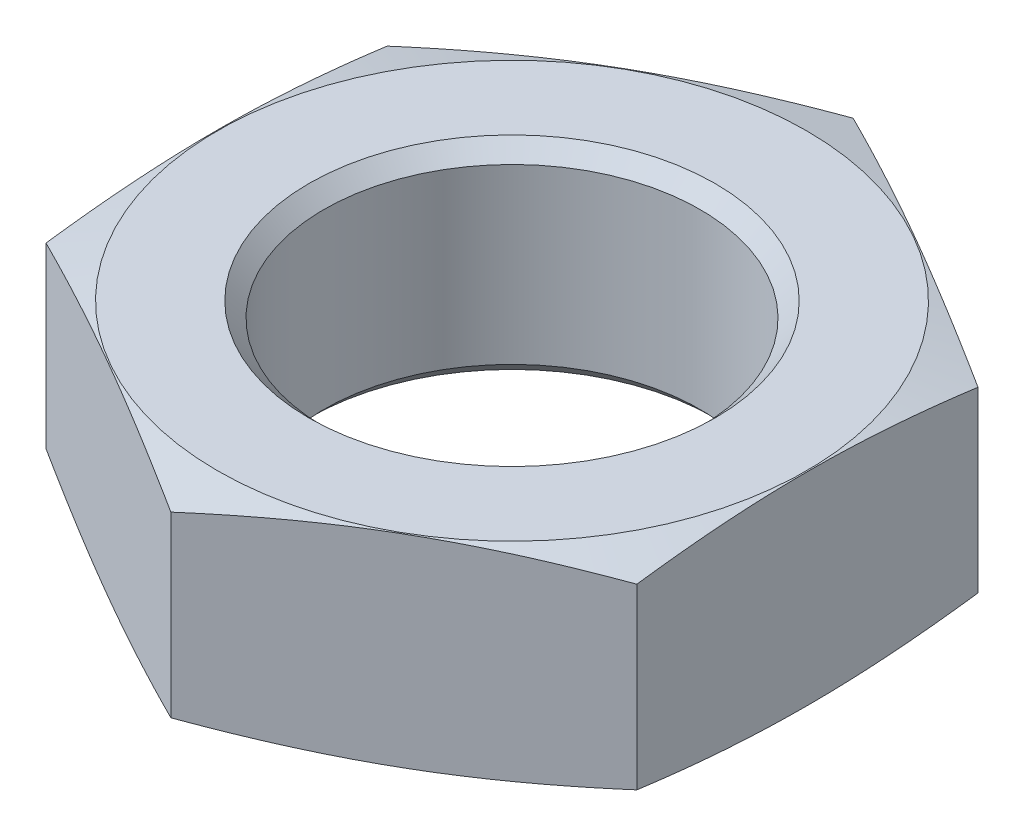
ISO-10303-21;
HEADER;
FILE_DESCRIPTION(('STEP AP214'),'2;1');
FILE_NAME('part.step','',(''),(''),'','','');
FILE_SCHEMA(('AUTOMOTIVE_DESIGN { 1 0 10303 214 1 1 1 1 }'));
ENDSEC;
DATA;
#1=APPLICATION_CONTEXT('core data for automotive mechanical design processes');
#2=APPLICATION_PROTOCOL_DEFINITION('international standard','automotive_design',2000,#1);
#3=PRODUCT_CONTEXT('',#1,'mechanical');
#4=PRODUCT('Part','Part','',(#3));
#5=PRODUCT_RELATED_PRODUCT_CATEGORY('part','',(#4));
#6=PRODUCT_DEFINITION_FORMATION('','',#4);
#7=PRODUCT_DEFINITION_CONTEXT('part definition',#1,'design');
#8=PRODUCT_DEFINITION('design','',#6,#7);
#9=PRODUCT_DEFINITION_SHAPE('','',#8);
#10=(LENGTH_UNIT() NAMED_UNIT(*) SI_UNIT(.MILLI.,.METRE.));
#11=(NAMED_UNIT(*) PLANE_ANGLE_UNIT() SI_UNIT($,.RADIAN.));
#12=(NAMED_UNIT(*) SI_UNIT($,.STERADIAN.) SOLID_ANGLE_UNIT());
#13=UNCERTAINTY_MEASURE_WITH_UNIT(LENGTH_MEASURE(1.E-05),#10,'distance_accuracy_value','');
#14=(GEOMETRIC_REPRESENTATION_CONTEXT(3) GLOBAL_UNCERTAINTY_ASSIGNED_CONTEXT((#13)) GLOBAL_UNIT_ASSIGNED_CONTEXT((#10,
#11,#12)) REPRESENTATION_CONTEXT('',''));
#15=CARTESIAN_POINT('',(0.,0.,0.));
#16=DIRECTION('',(0.,0.,1.));
#17=DIRECTION('',(1.,0.,0.));
#18=AXIS2_PLACEMENT_3D('',#15,#16,#17);
#19=CARTESIAN_POINT('',(0.,0.,0.));
#20=DIRECTION('',(0.,1.,0.));
#21=DIRECTION('',(0.,0.,1.));
#22=AXIS2_PLACEMENT_3D('',#19,#20,#21);
#23=PLANE('',#22);
#24=CARTESIAN_POINT('',(0.,0.,0.));
#25=DIRECTION('',(0.,-1.,0.));
#26=DIRECTION('',(0.,0.,-1.));
#27=AXIS2_PLACEMENT_3D('',#24,#25,#26);
#28=CIRCLE('',#27,15.95);
#29=CARTESIAN_POINT('',(0.,0.,-15.95));
#30=VERTEX_POINT('',#29);
#31=EDGE_CURVE('E114',#30,#30,#28,.T.);
#32=ORIENTED_EDGE('',*,*,#31,.F.);
#33=EDGE_LOOP('',(#32));
#34=FACE_BOUND('',#33,.T.);
#35=CARTESIAN_POINT('',(0.,0.,0.));
#36=DIRECTION('',(0.,1.,0.));
#37=DIRECTION('',(0.,0.,1.));
#38=AXIS2_PLACEMENT_3D('',#35,#36,#37);
#39=CIRCLE('',#38,11.);
#40=CARTESIAN_POINT('',(0.,0.,11.));
#41=VERTEX_POINT('',#40);
#42=EDGE_CURVE('E105',#41,#41,#39,.T.);
#43=ORIENTED_EDGE('',*,*,#42,.F.);
#44=EDGE_LOOP('',(#43));
#45=FACE_BOUND('',#44,.T.);
#46=ADVANCED_FACE('F36',(#34,#45),#23,.T.);
#47=CARTESIAN_POINT('',(15.95,-11.,0.));
#48=DIRECTION('',(0.,-1.,0.));
#49=DIRECTION('',(0.,0.,-1.));
#50=AXIS2_PLACEMENT_3D('',#47,#48,#49);
#51=PLANE('',#50);
#52=CARTESIAN_POINT('',(0.,-11.,0.));
#53=DIRECTION('',(0.,-1.,0.));
#54=DIRECTION('',(0.,0.,-1.));
#55=AXIS2_PLACEMENT_3D('',#52,#53,#54);
#56=CIRCLE('',#55,15.95);
#57=CARTESIAN_POINT('',(0.,-11.,-15.95));
#58=VERTEX_POINT('',#57);
#59=EDGE_CURVE('E111',#58,#58,#56,.T.);
#60=ORIENTED_EDGE('',*,*,#59,.T.);
#61=EDGE_LOOP('',(#60));
#62=FACE_BOUND('',#61,.T.);
#63=CARTESIAN_POINT('',(0.,-11.,0.));
#64=DIRECTION('',(0.,1.,0.));
#65=DIRECTION('',(0.,0.,1.));
#66=AXIS2_PLACEMENT_3D('',#63,#64,#65);
#67=CIRCLE('',#66,11.);
#68=CARTESIAN_POINT('',(0.,-11.,11.));
#69=VERTEX_POINT('',#68);
#70=EDGE_CURVE('E348',#69,#69,#67,.T.);
#71=ORIENTED_EDGE('',*,*,#70,.T.);
#72=EDGE_LOOP('',(#71));
#73=FACE_BOUND('',#72,.T.);
#74=ADVANCED_FACE('F137',(#62,#73),#51,.T.);
#75=CARTESIAN_POINT('',(0.,-5.5,0.));
#76=DIRECTION('',(0.,-1.,0.));
#77=DIRECTION('',(0.,0.,-1.));
#78=AXIS2_PLACEMENT_3D('',#75,#76,#77);
#79=CONICAL_SURFACE('',#78,36.476279441629,1.30899693899575);
#80=ORIENTED_EDGE('',*,*,#31,.T.);
#81=EDGE_LOOP('',(#80));
#82=FACE_BOUND('',#81,.T.);
#83=CARTESIAN_POINT('',(0.000200000000000058,-0.676658549257367,-18.4753240841218));
#84=CARTESIAN_POINT('',(-0.664256425539981,-0.573825955198311,-18.0916999879716));
#85=CARTESIAN_POINT('',(-1.32991754536375,-0.480471105415214,-17.7073803612522));
#86=CARTESIAN_POINT('',(-2.66359049888979,-0.316455601474747,-16.9373839225231));
#87=CARTESIAN_POINT('',(-3.33160317627743,-0.24580416423021,-16.5517066234112));
#88=CARTESIAN_POINT('',(-4.66592929612311,-0.131319876837691,-15.7813330789316));
#89=CARTESIAN_POINT('',(-5.3322337168711,-0.0873505062203012,-15.3966420422505));
#90=CARTESIAN_POINT('',(-6.66569221799257,-0.0283921008023866,-14.6267694176748));
#91=CARTESIAN_POINT('',(-7.33284610899628,-0.0133974596215517,-14.2415879391129));
#92=CARTESIAN_POINT('',(-8.66715389100372,-0.0133974596215524,-13.4712249819891));
#93=CARTESIAN_POINT('',(-9.33430778200743,-0.0283921008023879,-13.0860435034272));
#94=CARTESIAN_POINT('',(-10.6677662831289,-0.0873505062203029,-12.3161708788515));
#95=CARTESIAN_POINT('',(-11.3340707038769,-0.131319876837692,-11.9314798421704));
#96=CARTESIAN_POINT('',(-12.6683968237226,-0.245804164230211,-11.1611062976908));
#97=CARTESIAN_POINT('',(-13.3364095011102,-0.316455601474749,-10.7754289985789));
#98=CARTESIAN_POINT('',(-14.6700824546362,-0.480471105415218,-10.0054325598498));
#99=CARTESIAN_POINT('',(-15.33574357446,-0.573825955198315,-9.62111293313044));
#100=CARTESIAN_POINT('',(-16.0002,-0.676658549257372,-9.23748883698016));
#101=B_SPLINE_CURVE_WITH_KNOTS('',3,(#83,#84,#85,#86,#87,#88,#89,#90,#91,#92,#93,#94,#95,#96,
#97,#98,#99,#100),.UNSPECIFIED.,.F.,.F.,(4,2,2,2,2,2,2,2,4),(0.,2.32244786299619,
4.64583738335102,6.957236637786,9.26818860999879,11.5791405822116,13.8905398366466,
16.2139293570014,18.5363772199976),.UNSPECIFIED.);
#102=CARTESIAN_POINT('',(0.,-0.676627608859629,-18.475208614068));
#103=VERTEX_POINT('',#102);
#104=CARTESIAN_POINT('',(-16.,-0.676627608859635,-9.237604307034));
#105=VERTEX_POINT('',#104);
#106=EDGE_CURVE('E110',#103,#105,#101,.T.);
#107=ORIENTED_EDGE('',*,*,#106,.T.);
#108=CARTESIAN_POINT('',(-16.,-3.62774199219797,-24.7708750610416));
#109=CARTESIAN_POINT('',(-16.,-3.46351002450146,-24.0410196926535));
#110=CARTESIAN_POINT('',(-16.,-3.3012316789468,-23.3107169160599));
#111=CARTESIAN_POINT('',(-16.,-2.98163752452867,-21.8489960429334));
#112=CARTESIAN_POINT('',(-16.,-2.82432192039089,-21.1175779016903));
#113=CARTESIAN_POINT('',(-16.,-2.51558249709015,-19.6528028696696));
#114=CARTESIAN_POINT('',(-16.,-2.36416414324443,-18.9194448229351));
#115=CARTESIAN_POINT('',(-16.,-2.06879994828159,-17.4512262023437));
#116=CARTESIAN_POINT('',(-16.,-1.92485404730293,-16.7163656405723));
#117=CARTESIAN_POINT('',(-16.,-1.64736851170715,-15.2509326225095));
#118=CARTESIAN_POINT('',(-16.,-1.51375303884585,-14.5203745955153));
#119=CARTESIAN_POINT('',(-16.,-1.25782069758783,-13.0572667717478));
#120=CARTESIAN_POINT('',(-16.,-1.13550386966443,-12.3247169678493));
#121=CARTESIAN_POINT('',(-16.,-0.90485600230211,-10.8574664240545));
#122=CARTESIAN_POINT('',(-16.,-0.796523728773387,-10.1227658798136));
#123=CARTESIAN_POINT('',(-16.,-0.596974344055776,-8.65101734263474));
#124=CARTESIAN_POINT('',(-16.,-0.505757263283094,-7.91396934552738));
#125=CARTESIAN_POINT('',(-16.,-0.342943123303334,-6.42904639914294));
#126=CARTESIAN_POINT('',(-16.,-0.27158523987824,-5.68114483581523));
#127=CARTESIAN_POINT('',(-16.,-0.153369647571492,-4.18339082513652));
#128=CARTESIAN_POINT('',(-16.,-0.106511375565153,-3.43353842302381));
#129=CARTESIAN_POINT('',(-16.,-0.0400229807772697,-1.93298851255599));
#130=CARTESIAN_POINT('',(-16.,-0.0203788867534141,-1.18229163600119));
#131=CARTESIAN_POINT('',(-16.,-0.00953346324580208,0.319309829646697));
#132=CARTESIAN_POINT('',(-16.,-0.0183320549205155,1.07021441815825));
#133=CARTESIAN_POINT('',(-16.,-0.0638883698870331,2.57413048696097));
#134=CARTESIAN_POINT('',(-16.,-0.10075655016124,3.32713855210808));
#135=CARTESIAN_POINT('',(-16.,-0.200327668268556,4.83142906312342));
#136=CARTESIAN_POINT('',(-16.,-0.263031200721038,5.58271146887412));
#137=CARTESIAN_POINT('',(-16.,-0.411024077746778,7.08354735280372));
#138=CARTESIAN_POINT('',(-16.,-0.496329299356741,7.83309924051592));
#139=CARTESIAN_POINT('',(-16.,-0.685873338036574,9.32977555662255));
#140=CARTESIAN_POINT('',(-16.,-0.790112178817329,10.0768999819758));
#141=CARTESIAN_POINT('',(-16.,-1.01792157147905,11.5943517577453));
#142=CARTESIAN_POINT('',(-16.,-1.14203198881389,12.3645973089126));
#143=CARTESIAN_POINT('',(-16.,-1.40354465060315,13.9028412427698));
#144=CARTESIAN_POINT('',(-16.,-1.54094741021767,14.6708395371753));
#145=CARTESIAN_POINT('',(-16.,-1.82637313878195,16.2049616793753));
#146=CARTESIAN_POINT('',(-16.,-1.97439761083086,16.9710852459475));
#147=CARTESIAN_POINT('',(-16.,-2.2789114596203,18.5016305435053));
#148=CARTESIAN_POINT('',(-16.,-2.43540072480265,19.266052296781));
#149=CARTESIAN_POINT('',(-16.,-2.75523400075419,20.7937592932322));
#150=CARTESIAN_POINT('',(-16.,-2.91858059471854,21.5570439938992));
#151=CARTESIAN_POINT('',(-16.,-3.25076843519386,23.0824157930496));
#152=CARTESIAN_POINT('',(-16.,-3.41960969460553,23.8445028887169));
#153=CARTESIAN_POINT('',(-16.,-3.76175139763648,25.3676034012425));
#154=CARTESIAN_POINT('',(-16.,-3.93505144857046,26.1286169064672));
#155=CARTESIAN_POINT('',(-16.,-4.28533304822626,27.6497969695007));
#156=CARTESIAN_POINT('',(-16.,-4.46231460688866,28.4099635250167));
#157=CARTESIAN_POINT('',(-16.,-4.99372983726429,30.6720556501963));
#158=CARTESIAN_POINT('',(-16.,-5.35257008375717,32.1729457766813));
#159=CARTESIAN_POINT('',(-16.,-6.07858762086328,35.1727396242923));
#160=CARTESIAN_POINT('',(-16.,-6.4457651200045,36.6716432947392));
#161=CARTESIAN_POINT('',(-16.,-7.18563805959825,39.6656628161139));
#162=CARTESIAN_POINT('',(-16.,-7.55832423752252,41.1607809583153));
#163=CARTESIAN_POINT('',(-16.,-8.12075068317079,43.402573801004));
#164=CARTESIAN_POINT('',(-16.,-8.30878874741106,44.1496764644027));
#165=CARTESIAN_POINT('',(-16.,-8.68586359570953,45.6436289887007));
#166=CARTESIAN_POINT('',(-16.,-8.87490037881613,46.3904788498401));
#167=CARTESIAN_POINT('',(-16.,-9.06436871706437,47.137219260078));
#168=B_SPLINE_CURVE_WITH_KNOTS('',3,(#108,#109,#110,#111,#112,#113,#114,#115,#116,#117,#118,
#119,#120,#121,#122,#123,#124,#125,#126,#127,#128,#129,#130,#131,#132,#133,#134,#135,#136,#137,
#138,#139,#140,#141,#142,#143,#144,#145,#146,#147,#148,#149,#150,#151,#152,#153,#154,#155,#156,
#157,#158,#159,#160,#161,#162,#163,#164,#165,#166,#167),.UNSPECIFIED.,.F.,.F.,(4,2,2,2,2,2,2,2,
2,2,2,2,2,2,2,2,2,2,2,2,2,2,2,2,2,2,2,2,2,4),(0.,2.24432353506649,4.48873953343089,
6.73518832944211,8.98161912645846,11.2095772964548,13.4375434469966,15.6653128524322,
17.8930862169031,20.1466309586424,22.400123900276,24.6524595121588,26.9047888806989,
29.1660275237924,31.427318213841,33.6902016266707,35.9530878733663,38.2934841038468,
40.6339710754566,42.9747899095949,45.3155779014114,47.6572557363191,49.9989390695457,
52.3404168721686,54.6819009979208,59.3114337618147,63.9410824455326,68.5636752739821,
70.8748836420539,73.1860898084),.UNSPECIFIED.);
#169=CARTESIAN_POINT('',(-16.,-0.676627608859635,9.237604307034));
#170=VERTEX_POINT('',#169);
#171=EDGE_CURVE('E102',#105,#170,#168,.T.);
#172=ORIENTED_EDGE('',*,*,#171,.T.);
#173=CARTESIAN_POINT('',(-16.0002,-0.676658549257373,9.23748883698016));
#174=CARTESIAN_POINT('',(-15.33574357446,-0.573825955198317,9.62111293313044));
#175=CARTESIAN_POINT('',(-14.6700824546362,-0.480471105415219,10.0054325598498));
#176=CARTESIAN_POINT('',(-13.3364095011102,-0.31645560147475,10.7754289985789));
#177=CARTESIAN_POINT('',(-12.6683968237226,-0.245804164230212,11.1611062976908));
#178=CARTESIAN_POINT('',(-11.3340707038769,-0.131319876837693,11.9314798421704));
#179=CARTESIAN_POINT('',(-10.6677662831289,-0.0873505062203036,12.3161708788515));
#180=CARTESIAN_POINT('',(-9.33430778200743,-0.028392100802388,13.0860435034272));
#181=CARTESIAN_POINT('',(-8.66715389100372,-0.0133974596215515,13.4712249819891));
#182=CARTESIAN_POINT('',(-7.33284610899628,-0.0133974596215504,14.2415879391129));
#183=CARTESIAN_POINT('',(-6.66569221799256,-0.0283921008023858,14.6267694176748));
#184=CARTESIAN_POINT('',(-5.3322337168711,-0.0873505062203006,15.3966420422505));
#185=CARTESIAN_POINT('',(-4.6659292961231,-0.13131987683769,15.7813330789316));
#186=CARTESIAN_POINT('',(-3.33160317627743,-0.245804164230209,16.5517066234112));
#187=CARTESIAN_POINT('',(-2.66359049888979,-0.316455601474747,16.9373839225231));
#188=CARTESIAN_POINT('',(-1.32991754536375,-0.480471105415214,17.7073803612522));
#189=CARTESIAN_POINT('',(-0.664256425539977,-0.573825955198311,18.0916999879716));
#190=CARTESIAN_POINT('',(0.000200000000002396,-0.676658549257367,18.4753240841218));
#191=B_SPLINE_CURVE_WITH_KNOTS('',3,(#173,#174,#175,#176,#177,#178,#179,#180,#181,#182,#183,
#184,#185,#186,#187,#188,#189,#190),.UNSPECIFIED.,.F.,.F.,(4,2,2,2,2,2,2,2,4),(0.,
2.32244786299619,4.64583738335102,6.957236637786,9.26818860999879,11.5791405822116,
13.8905398366466,16.2139293570014,18.5363772199976),.UNSPECIFIED.);
#192=CARTESIAN_POINT('',(0.,-0.67662760885963,18.475208614068));
#193=VERTEX_POINT('',#192);
#194=EDGE_CURVE('E91',#170,#193,#191,.T.);
#195=ORIENTED_EDGE('',*,*,#194,.T.);
#196=CARTESIAN_POINT('',(-0.000200000000000058,-0.676658549257367,18.4753240841218));
#197=CARTESIAN_POINT('',(0.664256425539981,-0.573825955198311,18.0916999879716));
#198=CARTESIAN_POINT('',(1.32991754536375,-0.480471105415214,17.7073803612522));
#199=CARTESIAN_POINT('',(2.66359049888979,-0.316455601474747,16.9373839225231));
#200=CARTESIAN_POINT('',(3.33160317627743,-0.24580416423021,16.5517066234112));
#201=CARTESIAN_POINT('',(4.66592929612311,-0.131319876837691,15.7813330789316));
#202=CARTESIAN_POINT('',(5.3322337168711,-0.0873505062203012,15.3966420422505));
#203=CARTESIAN_POINT('',(6.66569221799257,-0.0283921008023866,14.6267694176748));
#204=CARTESIAN_POINT('',(7.33284610899628,-0.0133974596215517,14.2415879391129));
#205=CARTESIAN_POINT('',(8.66715389100372,-0.0133974596215524,13.4712249819891));
#206=CARTESIAN_POINT('',(9.33430778200743,-0.0283921008023879,13.0860435034272));
#207=CARTESIAN_POINT('',(10.6677662831289,-0.0873505062203029,12.3161708788515));
#208=CARTESIAN_POINT('',(11.3340707038769,-0.131319876837692,11.9314798421704));
#209=CARTESIAN_POINT('',(12.6683968237226,-0.245804164230211,11.1611062976908));
#210=CARTESIAN_POINT('',(13.3364095011102,-0.316455601474749,10.7754289985789));
#211=CARTESIAN_POINT('',(14.6700824546362,-0.480471105415218,10.0054325598498));
#212=CARTESIAN_POINT('',(15.33574357446,-0.573825955198315,9.62111293313044));
#213=CARTESIAN_POINT('',(16.0002,-0.676658549257372,9.23748883698016));
#214=B_SPLINE_CURVE_WITH_KNOTS('',3,(#196,#197,#198,#199,#200,#201,#202,#203,#204,#205,#206,
#207,#208,#209,#210,#211,#212,#213),.UNSPECIFIED.,.F.,.F.,(4,2,2,2,2,2,2,2,4),(0.,
2.32244786299619,4.64583738335102,6.957236637786,9.26818860999879,11.5791405822116,
13.8905398366466,16.2139293570014,18.5363772199976),.UNSPECIFIED.);
#215=CARTESIAN_POINT('',(16.,-0.676627608859635,9.237604307034));
#216=VERTEX_POINT('',#215);
#217=EDGE_CURVE('E96',#193,#216,#214,.T.);
#218=ORIENTED_EDGE('',*,*,#217,.T.);
#219=CARTESIAN_POINT('',(16.,-3.62774199219797,-24.7708750610416));
#220=CARTESIAN_POINT('',(16.,-3.46351002450146,-24.0410196926535));
#221=CARTESIAN_POINT('',(16.,-3.3012316789468,-23.3107169160599));
#222=CARTESIAN_POINT('',(16.,-2.98163752452867,-21.8489960429334));
#223=CARTESIAN_POINT('',(16.,-2.82432192039089,-21.1175779016903));
#224=CARTESIAN_POINT('',(16.,-2.51558249709015,-19.6528028696696));
#225=CARTESIAN_POINT('',(16.,-2.36416414324443,-18.9194448229351));
#226=CARTESIAN_POINT('',(16.,-2.06879994828159,-17.4512262023437));
#227=CARTESIAN_POINT('',(16.,-1.92485404730293,-16.7163656405723));
#228=CARTESIAN_POINT('',(16.,-1.64736851170715,-15.2509326225095));
#229=CARTESIAN_POINT('',(16.,-1.51375303884585,-14.5203745955153));
#230=CARTESIAN_POINT('',(16.,-1.25782069758783,-13.0572667717478));
#231=CARTESIAN_POINT('',(16.,-1.13550386966443,-12.3247169678493));
#232=CARTESIAN_POINT('',(16.,-0.90485600230211,-10.8574664240545));
#233=CARTESIAN_POINT('',(16.,-0.796523728773387,-10.1227658798136));
#234=CARTESIAN_POINT('',(16.,-0.596974344055776,-8.65101734263474));
#235=CARTESIAN_POINT('',(16.,-0.505757263283094,-7.91396934552738));
#236=CARTESIAN_POINT('',(16.,-0.342943123303334,-6.42904639914294));
#237=CARTESIAN_POINT('',(16.,-0.27158523987824,-5.68114483581523));
#238=CARTESIAN_POINT('',(16.,-0.153369647571492,-4.18339082513652));
#239=CARTESIAN_POINT('',(16.,-0.106511375565153,-3.43353842302381));
#240=CARTESIAN_POINT('',(16.,-0.0400229807772697,-1.93298851255599));
#241=CARTESIAN_POINT('',(16.,-0.0203788867534141,-1.18229163600119));
#242=CARTESIAN_POINT('',(16.,-0.00953346324580208,0.319309829646697));
#243=CARTESIAN_POINT('',(16.,-0.0183320549205155,1.07021441815825));
#244=CARTESIAN_POINT('',(16.,-0.0638883698870331,2.57413048696097));
#245=CARTESIAN_POINT('',(16.,-0.10075655016124,3.32713855210808));
#246=CARTESIAN_POINT('',(16.,-0.200327668268556,4.83142906312342));
#247=CARTESIAN_POINT('',(16.,-0.263031200721038,5.58271146887412));
#248=CARTESIAN_POINT('',(16.,-0.411024077746778,7.08354735280372));
#249=CARTESIAN_POINT('',(16.,-0.496329299356741,7.83309924051592));
#250=CARTESIAN_POINT('',(16.,-0.685873338036574,9.32977555662255));
#251=CARTESIAN_POINT('',(16.,-0.790112178817329,10.0768999819758));
#252=CARTESIAN_POINT('',(16.,-1.01792157147905,11.5943517577453));
#253=CARTESIAN_POINT('',(16.,-1.14203198881389,12.3645973089126));
#254=CARTESIAN_POINT('',(16.,-1.40354465060315,13.9028412427698));
#255=CARTESIAN_POINT('',(16.,-1.54094741021767,14.6708395371753));
#256=CARTESIAN_POINT('',(16.,-1.82637313878195,16.2049616793753));
#257=CARTESIAN_POINT('',(16.,-1.97439761083086,16.9710852459475));
#258=CARTESIAN_POINT('',(16.,-2.2789114596203,18.5016305435053));
#259=CARTESIAN_POINT('',(16.,-2.43540072480265,19.266052296781));
#260=CARTESIAN_POINT('',(16.,-2.75523400075419,20.7937592932322));
#261=CARTESIAN_POINT('',(16.,-2.91858059471854,21.5570439938992));
#262=CARTESIAN_POINT('',(16.,-3.25076843519386,23.0824157930496));
#263=CARTESIAN_POINT('',(16.,-3.41960969460553,23.8445028887169));
#264=CARTESIAN_POINT('',(16.,-3.76175139763648,25.3676034012425));
#265=CARTESIAN_POINT('',(16.,-3.93505144857046,26.1286169064672));
#266=CARTESIAN_POINT('',(16.,-4.28533304822626,27.6497969695007));
#267=CARTESIAN_POINT('',(16.,-4.46231460688866,28.4099635250167));
#268=CARTESIAN_POINT('',(16.,-4.99372983726429,30.6720556501963));
#269=CARTESIAN_POINT('',(16.,-5.35257008375717,32.1729457766813));
#270=CARTESIAN_POINT('',(16.,-6.07858762086328,35.1727396242923));
#271=CARTESIAN_POINT('',(16.,-6.4457651200045,36.6716432947392));
#272=CARTESIAN_POINT('',(16.,-7.18563805959825,39.6656628161139));
#273=CARTESIAN_POINT('',(16.,-7.55832423752252,41.1607809583153));
#274=CARTESIAN_POINT('',(16.,-8.12075068317079,43.402573801004));
#275=CARTESIAN_POINT('',(16.,-8.30878874741106,44.1496764644027));
#276=CARTESIAN_POINT('',(16.,-8.68586359570953,45.6436289887007));
#277=CARTESIAN_POINT('',(16.,-8.87490037881613,46.3904788498401));
#278=CARTESIAN_POINT('',(16.,-9.06436871706437,47.137219260078));
#279=B_SPLINE_CURVE_WITH_KNOTS('',3,(#219,#220,#221,#222,#223,#224,#225,#226,#227,#228,#229,
#230,#231,#232,#233,#234,#235,#236,#237,#238,#239,#240,#241,#242,#243,#244,#245,#246,#247,#248,
#249,#250,#251,#252,#253,#254,#255,#256,#257,#258,#259,#260,#261,#262,#263,#264,#265,#266,#267,
#268,#269,#270,#271,#272,#273,#274,#275,#276,#277,#278),.UNSPECIFIED.,.F.,.F.,(4,2,2,2,2,2,2,2,
2,2,2,2,2,2,2,2,2,2,2,2,2,2,2,2,2,2,2,2,2,4),(0.,2.24432353506649,4.48873953343089,
6.73518832944211,8.98161912645846,11.2095772964548,13.4375434469966,15.6653128524322,
17.8930862169031,20.1466309586424,22.400123900276,24.6524595121588,26.9047888806989,
29.1660275237924,31.427318213841,33.6902016266707,35.9530878733663,38.2934841038468,
40.6339710754566,42.9747899095949,45.3155779014114,47.6572557363191,49.9989390695457,
52.3404168721686,54.6819009979208,59.3114337618147,63.9410824455326,68.5636752739821,
70.8748836420539,73.1860898084),.UNSPECIFIED.);
#280=CARTESIAN_POINT('',(16.,-0.676627608859635,-9.237604307034));
#281=VERTEX_POINT('',#280);
#282=EDGE_CURVE('E200',#216,#281,#279,.F.);
#283=ORIENTED_EDGE('',*,*,#282,.T.);
#284=CARTESIAN_POINT('',(16.0002,-0.676658549257373,-9.23748883698016));
#285=CARTESIAN_POINT('',(15.33574357446,-0.573825955198317,-9.62111293313044));
#286=CARTESIAN_POINT('',(14.6700824546362,-0.480471105415219,-10.0054325598498));
#287=CARTESIAN_POINT('',(13.3364095011102,-0.31645560147475,-10.7754289985789));
#288=CARTESIAN_POINT('',(12.6683968237226,-0.245804164230212,-11.1611062976908));
#289=CARTESIAN_POINT('',(11.3340707038769,-0.131319876837693,-11.9314798421704));
#290=CARTESIAN_POINT('',(10.6677662831289,-0.0873505062203036,-12.3161708788515));
#291=CARTESIAN_POINT('',(9.33430778200743,-0.028392100802388,-13.0860435034272));
#292=CARTESIAN_POINT('',(8.66715389100372,-0.0133974596215515,-13.4712249819891));
#293=CARTESIAN_POINT('',(7.33284610899628,-0.0133974596215504,-14.2415879391129));
#294=CARTESIAN_POINT('',(6.66569221799256,-0.0283921008023858,-14.6267694176748));
#295=CARTESIAN_POINT('',(5.3322337168711,-0.0873505062203006,-15.3966420422505));
#296=CARTESIAN_POINT('',(4.6659292961231,-0.13131987683769,-15.7813330789316));
#297=CARTESIAN_POINT('',(3.33160317627743,-0.245804164230209,-16.5517066234112));
#298=CARTESIAN_POINT('',(2.66359049888979,-0.316455601474747,-16.9373839225231));
#299=CARTESIAN_POINT('',(1.32991754536375,-0.480471105415214,-17.7073803612522));
#300=CARTESIAN_POINT('',(0.664256425539977,-0.573825955198311,-18.0916999879716));
#301=CARTESIAN_POINT('',(-0.000200000000002396,-0.676658549257367,-18.4753240841218));
#302=B_SPLINE_CURVE_WITH_KNOTS('',3,(#284,#285,#286,#287,#288,#289,#290,#291,#292,#293,#294,
#295,#296,#297,#298,#299,#300,#301),.UNSPECIFIED.,.F.,.F.,(4,2,2,2,2,2,2,2,4),(0.,
2.32244786299619,4.64583738335102,6.957236637786,9.26818860999879,11.5791405822116,
13.8905398366466,16.2139293570014,18.5363772199976),.UNSPECIFIED.);
#303=EDGE_CURVE('E116',#281,#103,#302,.T.);
#304=ORIENTED_EDGE('',*,*,#303,.T.);
#305=EDGE_LOOP('',(#107,#172,#195,#218,#283,#304));
#306=FACE_BOUND('',#305,.T.);
#307=ADVANCED_FACE('F108',(#82,#306),#79,.T.);
#308=CARTESIAN_POINT('',(-16.,-12.,-9.237604307034));
#309=DIRECTION('',(-1.,0.,0.));
#310=DIRECTION('',(0.,0.,1.));
#311=AXIS2_PLACEMENT_3D('',#308,#309,#310);
#312=PLANE('',#311);
#313=DIRECTION('',(0.,1.,0.));
#314=VECTOR('',#313,1.);
#315=CARTESIAN_POINT('',(-16.,-12.,-9.237604307034));
#316=LINE('',#315,#314);
#317=CARTESIAN_POINT('',(-16.,-10.3233723911404,-9.237604307034));
#318=VERTEX_POINT('',#317);
#319=EDGE_CURVE('E97',#318,#105,#316,.T.);
#320=ORIENTED_EDGE('',*,*,#319,.F.);
#321=CARTESIAN_POINT('',(-16.,-7.37225800780203,-24.7708750610416));
#322=CARTESIAN_POINT('',(-16.,-7.53648997549854,-24.0410196926535));
#323=CARTESIAN_POINT('',(-16.,-7.6987683210532,-23.3107169160599));
#324=CARTESIAN_POINT('',(-16.,-8.01836247547133,-21.8489960429334));
#325=CARTESIAN_POINT('',(-16.,-8.17567807960911,-21.1175779016903));
#326=CARTESIAN_POINT('',(-16.,-8.48441750290985,-19.6528028696696));
#327=CARTESIAN_POINT('',(-16.,-8.63583585675557,-18.9194448229351));
#328=CARTESIAN_POINT('',(-16.,-8.93120005171841,-17.4512262023437));
#329=CARTESIAN_POINT('',(-16.,-9.07514595269707,-16.7163656405724));
#330=CARTESIAN_POINT('',(-16.,-9.35263148829285,-15.2509326225095));
#331=CARTESIAN_POINT('',(-16.,-9.48624696115415,-14.5203745955153));
#332=CARTESIAN_POINT('',(-16.,-9.74217930241216,-13.0572667717478));
#333=CARTESIAN_POINT('',(-16.,-9.86449613033557,-12.3247169678493));
#334=CARTESIAN_POINT('',(-16.,-10.0951439976979,-10.8574664240545));
#335=CARTESIAN_POINT('',(-16.,-10.2034762712266,-10.1227658798136));
#336=CARTESIAN_POINT('',(-16.,-10.4030256559442,-8.65101734263474));
#337=CARTESIAN_POINT('',(-16.,-10.4942427367169,-7.91396934552738));
#338=CARTESIAN_POINT('',(-16.,-10.6570568766967,-6.42904639914295));
#339=CARTESIAN_POINT('',(-16.,-10.7284147601218,-5.68114483581523));
#340=CARTESIAN_POINT('',(-16.,-10.8466303524285,-4.18339082513652));
#341=CARTESIAN_POINT('',(-16.,-10.8934886244348,-3.43353842302381));
#342=CARTESIAN_POINT('',(-16.,-10.9599770192227,-1.93298851255599));
#343=CARTESIAN_POINT('',(-16.,-10.9796211132466,-1.18229163600119));
#344=CARTESIAN_POINT('',(-16.,-10.9904665367542,0.319309829646699));
#345=CARTESIAN_POINT('',(-16.,-10.9816679450795,1.07021441815825));
#346=CARTESIAN_POINT('',(-16.,-10.936111630113,2.57413048696097));
#347=CARTESIAN_POINT('',(-16.,-10.8992434498388,3.32713855210808));
#348=CARTESIAN_POINT('',(-16.,-10.7996723317314,4.83142906312342));
#349=CARTESIAN_POINT('',(-16.,-10.736968799279,5.58271146887412));
#350=CARTESIAN_POINT('',(-16.,-10.5889759222532,7.08354735280372));
#351=CARTESIAN_POINT('',(-16.,-10.5036707006433,7.83309924051592));
#352=CARTESIAN_POINT('',(-16.,-10.3141266619634,9.32977555662255));
#353=CARTESIAN_POINT('',(-16.,-10.2098878211827,10.0768999819758));
#354=CARTESIAN_POINT('',(-16.,-9.98207842852096,11.5943517577453));
#355=CARTESIAN_POINT('',(-16.,-9.85796801118611,12.3645973089126));
#356=CARTESIAN_POINT('',(-16.,-9.59645534939685,13.9028412427698));
#357=CARTESIAN_POINT('',(-16.,-9.45905258978233,14.6708395371753));
#358=CARTESIAN_POINT('',(-16.,-9.17362686121805,16.2049616793753));
#359=CARTESIAN_POINT('',(-16.,-9.02560238916914,16.9710852459475));
#360=CARTESIAN_POINT('',(-16.,-8.7210885403797,18.5016305435053));
#361=CARTESIAN_POINT('',(-16.,-8.56459927519735,19.266052296781));
#362=CARTESIAN_POINT('',(-16.,-8.24476599924581,20.7937592932322));
#363=CARTESIAN_POINT('',(-16.,-8.08141940528147,21.5570439938991));
#364=CARTESIAN_POINT('',(-16.,-7.74923156480614,23.0824157930496));
#365=CARTESIAN_POINT('',(-16.,-7.58039030539447,23.8445028887169));
#366=CARTESIAN_POINT('',(-16.,-7.23824860236353,25.3676034012425));
#367=CARTESIAN_POINT('',(-16.,-7.06494855142955,26.1286169064672));
#368=CARTESIAN_POINT('',(-16.,-6.71466695177374,27.6497969695007));
#369=CARTESIAN_POINT('',(-16.,-6.53768539311134,28.4099635250167));
#370=CARTESIAN_POINT('',(-16.,-6.00627016273571,30.6720556501962));
#371=CARTESIAN_POINT('',(-16.,-5.64742991624284,32.1729457766813));
#372=CARTESIAN_POINT('',(-16.,-4.92141237913673,35.1727396242923));
#373=CARTESIAN_POINT('',(-16.,-4.5542348799955,36.6716432947392));
#374=CARTESIAN_POINT('',(-16.,-3.81436194040176,39.6656628161139));
#375=CARTESIAN_POINT('',(-16.,-3.44167576247748,41.1607809583153));
#376=CARTESIAN_POINT('',(-16.,-2.87924931682922,43.4025738010039));
#377=CARTESIAN_POINT('',(-16.,-2.69121125258894,44.1496764644027));
#378=CARTESIAN_POINT('',(-16.,-2.31413640429048,45.6436289887007));
#379=CARTESIAN_POINT('',(-16.,-2.12509962118387,46.3904788498401));
#380=CARTESIAN_POINT('',(-16.,-1.93563128293563,47.137219260078));
#381=B_SPLINE_CURVE_WITH_KNOTS('',3,(#321,#322,#323,#324,#325,#326,#327,#328,#329,#330,#331,
#332,#333,#334,#335,#336,#337,#338,#339,#340,#341,#342,#343,#344,#345,#346,#347,#348,#349,#350,
#351,#352,#353,#354,#355,#356,#357,#358,#359,#360,#361,#362,#363,#364,#365,#366,#367,#368,#369,
#370,#371,#372,#373,#374,#375,#376,#377,#378,#379,#380),.UNSPECIFIED.,.F.,.F.,(4,2,2,2,2,2,2,2,
2,2,2,2,2,2,2,2,2,2,2,2,2,2,2,2,2,2,2,2,2,4),(0.,2.24432353506649,4.48873953343089,
6.73518832944211,8.98161912645846,11.2095772964548,13.4375434469966,15.6653128524322,
17.8930862169031,20.1466309586425,22.400123900276,24.6524595121588,26.9047888806989,
29.1660275237924,31.427318213841,33.6902016266707,35.9530878733663,38.2934841038468,
40.6339710754566,42.9747899095949,45.3155779014114,47.6572557363191,49.9989390695457,
52.3404168721686,54.6819009979208,59.3114337618147,63.9410824455326,68.563675273982,
70.8748836420538,73.1860898084),.UNSPECIFIED.);
#382=CARTESIAN_POINT('',(-16.,-10.3233723911404,9.237604307034));
#383=VERTEX_POINT('',#382);
#384=EDGE_CURVE('E11',#383,#318,#381,.F.);
#385=ORIENTED_EDGE('',*,*,#384,.F.);
#386=DIRECTION('',(0.,1.,0.));
#387=VECTOR('',#386,1.);
#388=CARTESIAN_POINT('',(-16.,-12.,9.237604307034));
#389=LINE('',#388,#387);
#390=EDGE_CURVE('E61',#383,#170,#389,.T.);
#391=ORIENTED_EDGE('',*,*,#390,.T.);
#392=ORIENTED_EDGE('',*,*,#171,.F.);
#393=EDGE_LOOP('',(#320,#385,#391,#392));
#394=FACE_BOUND('',#393,.T.);
#395=ADVANCED_FACE('F101',(#394),#312,.T.);
#396=CARTESIAN_POINT('',(0.,-12.,-18.475208614068));
#397=DIRECTION('',(-0.5,0.,-0.866025403784439));
#398=DIRECTION('',(-0.866025403784439,0.,0.5));
#399=AXIS2_PLACEMENT_3D('',#396,#397,#398);
#400=PLANE('',#399);
#401=DIRECTION('',(0.,1.,0.));
#402=VECTOR('',#401,1.);
#403=CARTESIAN_POINT('',(0.,-12.,-18.475208614068));
#404=LINE('',#403,#402);
#405=CARTESIAN_POINT('',(0.,-10.3233723911404,-18.475208614068));
#406=VERTEX_POINT('',#405);
#407=EDGE_CURVE('E243',#406,#103,#404,.T.);
#408=ORIENTED_EDGE('',*,*,#407,.F.);
#409=CARTESIAN_POINT('',(-16.0002,-10.3233414507426,-9.23748883698016));
#410=CARTESIAN_POINT('',(-15.33574357446,-10.4261740448017,-9.62111293313044));
#411=CARTESIAN_POINT('',(-14.6700824546362,-10.5195288945848,-10.0054325598498));
#412=CARTESIAN_POINT('',(-13.3364095011102,-10.6835443985253,-10.7754289985789));
#413=CARTESIAN_POINT('',(-12.6683968237226,-10.7541958357698,-11.1611062976908));
#414=CARTESIAN_POINT('',(-11.3340707038769,-10.8686801231623,-11.9314798421704));
#415=CARTESIAN_POINT('',(-10.6677662831289,-10.9126494937797,-12.3161708788515));
#416=CARTESIAN_POINT('',(-9.33430778200743,-10.9716078991976,-13.0860435034272));
#417=CARTESIAN_POINT('',(-8.66715389100372,-10.9866025403784,-13.4712249819891));
#418=CARTESIAN_POINT('',(-7.33284610899628,-10.9866025403784,-14.2415879391129));
#419=CARTESIAN_POINT('',(-6.66569221799256,-10.9716078991976,-14.6267694176748));
#420=CARTESIAN_POINT('',(-5.3322337168711,-10.9126494937797,-15.3966420422505));
#421=CARTESIAN_POINT('',(-4.66592929612311,-10.8686801231623,-15.7813330789316));
#422=CARTESIAN_POINT('',(-3.33160317627743,-10.7541958357698,-16.5517066234112));
#423=CARTESIAN_POINT('',(-2.66359049888979,-10.6835443985253,-16.9373839225231));
#424=CARTESIAN_POINT('',(-1.32991754536375,-10.5195288945848,-17.7073803612522));
#425=CARTESIAN_POINT('',(-0.664256425539979,-10.4261740448017,-18.0916999879716));
#426=CARTESIAN_POINT('',(0.000200000000000166,-10.3233414507426,-18.4753240841218));
#427=B_SPLINE_CURVE_WITH_KNOTS('',3,(#409,#410,#411,#412,#413,#414,#415,#416,#417,#418,#419,
#420,#421,#422,#423,#424,#425,#426),.UNSPECIFIED.,.F.,.F.,(4,2,2,2,2,2,2,2,4),(0.,
2.32244786299619,4.64583738335102,6.95723663778599,9.26818860999879,11.5791405822116,
13.8905398366466,16.2139293570014,18.5363772199976),.UNSPECIFIED.);
#428=EDGE_CURVE('E49',#318,#406,#427,.T.);
#429=ORIENTED_EDGE('',*,*,#428,.F.);
#430=ORIENTED_EDGE('',*,*,#319,.T.);
#431=ORIENTED_EDGE('',*,*,#106,.F.);
#432=EDGE_LOOP('',(#408,#429,#430,#431));
#433=FACE_BOUND('',#432,.T.);
#434=ADVANCED_FACE('F134',(#433),#400,.T.);
#435=CARTESIAN_POINT('',(16.,-12.,-9.237604307034));
#436=DIRECTION('',(0.5,0.,-0.866025403784439));
#437=DIRECTION('',(-0.866025403784439,0.,-0.5));
#438=AXIS2_PLACEMENT_3D('',#435,#436,#437);
#439=PLANE('',#438);
#440=DIRECTION('',(0.,1.,0.));
#441=VECTOR('',#440,1.);
#442=CARTESIAN_POINT('',(16.,-12.,-9.237604307034));
#443=LINE('',#442,#441);
#444=CARTESIAN_POINT('',(16.,-10.3233723911404,-9.237604307034));
#445=VERTEX_POINT('',#444);
#446=EDGE_CURVE('E246',#445,#281,#443,.T.);
#447=ORIENTED_EDGE('',*,*,#446,.F.);
#448=CARTESIAN_POINT('',(-0.000200000000000964,-10.3233414507426,-18.4753240841218));
#449=CARTESIAN_POINT('',(0.664256425539978,-10.4261740448017,-18.0916999879716));
#450=CARTESIAN_POINT('',(1.32991754536375,-10.5195288945848,-17.7073803612522));
#451=CARTESIAN_POINT('',(2.66359049888979,-10.6835443985253,-16.9373839225231));
#452=CARTESIAN_POINT('',(3.33160317627743,-10.7541958357698,-16.5517066234112));
#453=CARTESIAN_POINT('',(4.66592929612311,-10.8686801231623,-15.7813330789316));
#454=CARTESIAN_POINT('',(5.3322337168711,-10.9126494937797,-15.3966420422505));
#455=CARTESIAN_POINT('',(6.66569221799256,-10.9716078991976,-14.6267694176748));
#456=CARTESIAN_POINT('',(7.33284610899628,-10.9866025403784,-14.2415879391129));
#457=CARTESIAN_POINT('',(8.66715389100372,-10.9866025403784,-13.4712249819891));
#458=CARTESIAN_POINT('',(9.33430778200743,-10.9716078991976,-13.0860435034272));
#459=CARTESIAN_POINT('',(10.6677662831289,-10.9126494937797,-12.3161708788515));
#460=CARTESIAN_POINT('',(11.3340707038769,-10.8686801231623,-11.9314798421704));
#461=CARTESIAN_POINT('',(12.6683968237226,-10.7541958357698,-11.1611062976908));
#462=CARTESIAN_POINT('',(13.3364095011102,-10.6835443985253,-10.775428998579));
#463=CARTESIAN_POINT('',(14.6700824546362,-10.5195288945848,-10.0054325598498));
#464=CARTESIAN_POINT('',(15.33574357446,-10.4261740448017,-9.62111293313045));
#465=CARTESIAN_POINT('',(16.0002,-10.3233414507426,-9.23748883698016));
#466=B_SPLINE_CURVE_WITH_KNOTS('',3,(#448,#449,#450,#451,#452,#453,#454,#455,#456,#457,#458,
#459,#460,#461,#462,#463,#464,#465),.UNSPECIFIED.,.F.,.F.,(4,2,2,2,2,2,2,2,4),(0.,
2.32244786299619,4.64583738335102,6.95723663778599,9.26818860999879,11.5791405822116,
13.8905398366466,16.2139293570014,18.5363772199976),.UNSPECIFIED.);
#467=EDGE_CURVE('E171',#406,#445,#466,.T.);
#468=ORIENTED_EDGE('',*,*,#467,.F.);
#469=ORIENTED_EDGE('',*,*,#407,.T.);
#470=ORIENTED_EDGE('',*,*,#303,.F.);
#471=EDGE_LOOP('',(#447,#468,#469,#470));
#472=FACE_BOUND('',#471,.T.);
#473=ADVANCED_FACE('F185',(#472),#439,.T.);
#474=CARTESIAN_POINT('',(16.,-12.,9.237604307034));
#475=DIRECTION('',(1.,0.,0.));
#476=DIRECTION('',(0.,0.,-1.));
#477=AXIS2_PLACEMENT_3D('',#474,#475,#476);
#478=PLANE('',#477);
#479=DIRECTION('',(0.,1.,0.));
#480=VECTOR('',#479,1.);
#481=CARTESIAN_POINT('',(16.,-12.,9.237604307034));
#482=LINE('',#481,#480);
#483=CARTESIAN_POINT('',(16.,-10.3233723911404,9.237604307034));
#484=VERTEX_POINT('',#483);
#485=EDGE_CURVE('E249',#484,#216,#482,.T.);
#486=ORIENTED_EDGE('',*,*,#485,.F.);
#487=CARTESIAN_POINT('',(16.,-7.37225800780203,-24.7708750610416));
#488=CARTESIAN_POINT('',(16.,-7.53648997549854,-24.0410196926535));
#489=CARTESIAN_POINT('',(16.,-7.6987683210532,-23.3107169160599));
#490=CARTESIAN_POINT('',(16.,-8.01836247547133,-21.8489960429334));
#491=CARTESIAN_POINT('',(16.,-8.17567807960911,-21.1175779016903));
#492=CARTESIAN_POINT('',(16.,-8.48441750290985,-19.6528028696696));
#493=CARTESIAN_POINT('',(16.,-8.63583585675557,-18.9194448229351));
#494=CARTESIAN_POINT('',(16.,-8.93120005171841,-17.4512262023437));
#495=CARTESIAN_POINT('',(16.,-9.07514595269707,-16.7163656405724));
#496=CARTESIAN_POINT('',(16.,-9.35263148829285,-15.2509326225095));
#497=CARTESIAN_POINT('',(16.,-9.48624696115415,-14.5203745955153));
#498=CARTESIAN_POINT('',(16.,-9.74217930241216,-13.0572667717478));
#499=CARTESIAN_POINT('',(16.,-9.86449613033557,-12.3247169678493));
#500=CARTESIAN_POINT('',(16.,-10.0951439976979,-10.8574664240545));
#501=CARTESIAN_POINT('',(16.,-10.2034762712266,-10.1227658798136));
#502=CARTESIAN_POINT('',(16.,-10.4030256559442,-8.65101734263474));
#503=CARTESIAN_POINT('',(16.,-10.4942427367169,-7.91396934552738));
#504=CARTESIAN_POINT('',(16.,-10.6570568766967,-6.42904639914295));
#505=CARTESIAN_POINT('',(16.,-10.7284147601218,-5.68114483581523));
#506=CARTESIAN_POINT('',(16.,-10.8466303524285,-4.18339082513652));
#507=CARTESIAN_POINT('',(16.,-10.8934886244348,-3.43353842302381));
#508=CARTESIAN_POINT('',(16.,-10.9599770192227,-1.93298851255599));
#509=CARTESIAN_POINT('',(16.,-10.9796211132466,-1.18229163600119));
#510=CARTESIAN_POINT('',(16.,-10.9904665367542,0.319309829646699));
#511=CARTESIAN_POINT('',(16.,-10.9816679450795,1.07021441815825));
#512=CARTESIAN_POINT('',(16.,-10.936111630113,2.57413048696097));
#513=CARTESIAN_POINT('',(16.,-10.8992434498388,3.32713855210808));
#514=CARTESIAN_POINT('',(16.,-10.7996723317314,4.83142906312342));
#515=CARTESIAN_POINT('',(16.,-10.736968799279,5.58271146887412));
#516=CARTESIAN_POINT('',(16.,-10.5889759222532,7.08354735280372));
#517=CARTESIAN_POINT('',(16.,-10.5036707006433,7.83309924051592));
#518=CARTESIAN_POINT('',(16.,-10.3141266619634,9.32977555662255));
#519=CARTESIAN_POINT('',(16.,-10.2098878211827,10.0768999819758));
#520=CARTESIAN_POINT('',(16.,-9.98207842852096,11.5943517577453));
#521=CARTESIAN_POINT('',(16.,-9.85796801118611,12.3645973089126));
#522=CARTESIAN_POINT('',(16.,-9.59645534939685,13.9028412427698));
#523=CARTESIAN_POINT('',(16.,-9.45905258978233,14.6708395371753));
#524=CARTESIAN_POINT('',(16.,-9.17362686121805,16.2049616793753));
#525=CARTESIAN_POINT('',(16.,-9.02560238916914,16.9710852459475));
#526=CARTESIAN_POINT('',(16.,-8.7210885403797,18.5016305435053));
#527=CARTESIAN_POINT('',(16.,-8.56459927519735,19.266052296781));
#528=CARTESIAN_POINT('',(16.,-8.24476599924581,20.7937592932322));
#529=CARTESIAN_POINT('',(16.,-8.08141940528147,21.5570439938991));
#530=CARTESIAN_POINT('',(16.,-7.74923156480614,23.0824157930496));
#531=CARTESIAN_POINT('',(16.,-7.58039030539447,23.8445028887169));
#532=CARTESIAN_POINT('',(16.,-7.23824860236353,25.3676034012425));
#533=CARTESIAN_POINT('',(16.,-7.06494855142955,26.1286169064672));
#534=CARTESIAN_POINT('',(16.,-6.71466695177374,27.6497969695007));
#535=CARTESIAN_POINT('',(16.,-6.53768539311134,28.4099635250167));
#536=CARTESIAN_POINT('',(16.,-6.00627016273571,30.6720556501962));
#537=CARTESIAN_POINT('',(16.,-5.64742991624284,32.1729457766813));
#538=CARTESIAN_POINT('',(16.,-4.92141237913673,35.1727396242923));
#539=CARTESIAN_POINT('',(16.,-4.5542348799955,36.6716432947392));
#540=CARTESIAN_POINT('',(16.,-3.81436194040176,39.6656628161139));
#541=CARTESIAN_POINT('',(16.,-3.44167576247748,41.1607809583153));
#542=CARTESIAN_POINT('',(16.,-2.87924931682922,43.4025738010039));
#543=CARTESIAN_POINT('',(16.,-2.69121125258894,44.1496764644027));
#544=CARTESIAN_POINT('',(16.,-2.31413640429048,45.6436289887007));
#545=CARTESIAN_POINT('',(16.,-2.12509962118387,46.3904788498401));
#546=CARTESIAN_POINT('',(16.,-1.93563128293563,47.137219260078));
#547=B_SPLINE_CURVE_WITH_KNOTS('',3,(#487,#488,#489,#490,#491,#492,#493,#494,#495,#496,#497,
#498,#499,#500,#501,#502,#503,#504,#505,#506,#507,#508,#509,#510,#511,#512,#513,#514,#515,#516,
#517,#518,#519,#520,#521,#522,#523,#524,#525,#526,#527,#528,#529,#530,#531,#532,#533,#534,#535,
#536,#537,#538,#539,#540,#541,#542,#543,#544,#545,#546),.UNSPECIFIED.,.F.,.F.,(4,2,2,2,2,2,2,2,
2,2,2,2,2,2,2,2,2,2,2,2,2,2,2,2,2,2,2,2,2,4),(0.,2.24432353506649,4.48873953343089,
6.73518832944211,8.98161912645846,11.2095772964548,13.4375434469966,15.6653128524322,
17.8930862169031,20.1466309586425,22.400123900276,24.6524595121588,26.9047888806989,
29.1660275237924,31.427318213841,33.6902016266707,35.9530878733663,38.2934841038468,
40.6339710754566,42.9747899095949,45.3155779014114,47.6572557363191,49.9989390695457,
52.3404168721686,54.6819009979208,59.3114337618147,63.9410824455326,68.563675273982,
70.8748836420538,73.1860898084),.UNSPECIFIED.);
#548=EDGE_CURVE('E164',#445,#484,#547,.T.);
#549=ORIENTED_EDGE('',*,*,#548,.F.);
#550=ORIENTED_EDGE('',*,*,#446,.T.);
#551=ORIENTED_EDGE('',*,*,#282,.F.);
#552=EDGE_LOOP('',(#486,#549,#550,#551));
#553=FACE_BOUND('',#552,.T.);
#554=ADVANCED_FACE('F191',(#553),#478,.T.);
#555=CARTESIAN_POINT('',(0.,-12.,18.475208614068));
#556=DIRECTION('',(0.5,0.,0.866025403784439));
#557=DIRECTION('',(0.866025403784439,0.,-0.5));
#558=AXIS2_PLACEMENT_3D('',#555,#556,#557);
#559=PLANE('',#558);
#560=DIRECTION('',(0.,1.,0.));
#561=VECTOR('',#560,1.);
#562=CARTESIAN_POINT('',(0.,-12.,18.475208614068));
#563=LINE('',#562,#561);
#564=CARTESIAN_POINT('',(0.,-10.3233723911404,18.475208614068));
#565=VERTEX_POINT('',#564);
#566=EDGE_CURVE('E56',#565,#193,#563,.T.);
#567=ORIENTED_EDGE('',*,*,#566,.F.);
#568=CARTESIAN_POINT('',(16.0002,-10.3233414507426,9.23748883698016));
#569=CARTESIAN_POINT('',(15.33574357446,-10.4261740448017,9.62111293313044));
#570=CARTESIAN_POINT('',(14.6700824546362,-10.5195288945848,10.0054325598498));
#571=CARTESIAN_POINT('',(13.3364095011102,-10.6835443985253,10.7754289985789));
#572=CARTESIAN_POINT('',(12.6683968237226,-10.7541958357698,11.1611062976908));
#573=CARTESIAN_POINT('',(11.3340707038769,-10.8686801231623,11.9314798421704));
#574=CARTESIAN_POINT('',(10.6677662831289,-10.9126494937797,12.3161708788515));
#575=CARTESIAN_POINT('',(9.33430778200743,-10.9716078991976,13.0860435034272));
#576=CARTESIAN_POINT('',(8.66715389100372,-10.9866025403784,13.4712249819891));
#577=CARTESIAN_POINT('',(7.33284610899628,-10.9866025403784,14.2415879391129));
#578=CARTESIAN_POINT('',(6.66569221799256,-10.9716078991976,14.6267694176748));
#579=CARTESIAN_POINT('',(5.3322337168711,-10.9126494937797,15.3966420422505));
#580=CARTESIAN_POINT('',(4.66592929612311,-10.8686801231623,15.7813330789316));
#581=CARTESIAN_POINT('',(3.33160317627743,-10.7541958357698,16.5517066234112));
#582=CARTESIAN_POINT('',(2.66359049888979,-10.6835443985253,16.9373839225231));
#583=CARTESIAN_POINT('',(1.32991754536375,-10.5195288945848,17.7073803612522));
#584=CARTESIAN_POINT('',(0.664256425539979,-10.4261740448017,18.0916999879716));
#585=CARTESIAN_POINT('',(-0.000200000000000166,-10.3233414507426,18.4753240841218));
#586=B_SPLINE_CURVE_WITH_KNOTS('',3,(#568,#569,#570,#571,#572,#573,#574,#575,#576,#577,#578,
#579,#580,#581,#582,#583,#584,#585),.UNSPECIFIED.,.F.,.F.,(4,2,2,2,2,2,2,2,4),(0.,
2.32244786299619,4.64583738335102,6.95723663778599,9.26818860999879,11.5791405822116,
13.8905398366466,16.2139293570014,18.5363772199976),.UNSPECIFIED.);
#587=EDGE_CURVE('E157',#484,#565,#586,.T.);
#588=ORIENTED_EDGE('',*,*,#587,.F.);
#589=ORIENTED_EDGE('',*,*,#485,.T.);
#590=ORIENTED_EDGE('',*,*,#217,.F.);
#591=EDGE_LOOP('',(#567,#588,#589,#590));
#592=FACE_BOUND('',#591,.T.);
#593=ADVANCED_FACE('F215',(#592),#559,.T.);
#594=CARTESIAN_POINT('',(-16.,-12.,9.237604307034));
#595=DIRECTION('',(-0.5,0.,0.866025403784439));
#596=DIRECTION('',(0.866025403784439,0.,0.5));
#597=AXIS2_PLACEMENT_3D('',#594,#595,#596);
#598=PLANE('',#597);
#599=ORIENTED_EDGE('',*,*,#390,.F.);
#600=CARTESIAN_POINT('',(0.000200000000000964,-10.3233414507426,18.4753240841218));
#601=CARTESIAN_POINT('',(-0.664256425539978,-10.4261740448017,18.0916999879716));
#602=CARTESIAN_POINT('',(-1.32991754536375,-10.5195288945848,17.7073803612522));
#603=CARTESIAN_POINT('',(-2.66359049888979,-10.6835443985253,16.9373839225231));
#604=CARTESIAN_POINT('',(-3.33160317627743,-10.7541958357698,16.5517066234112));
#605=CARTESIAN_POINT('',(-4.66592929612311,-10.8686801231623,15.7813330789316));
#606=CARTESIAN_POINT('',(-5.3322337168711,-10.9126494937797,15.3966420422505));
#607=CARTESIAN_POINT('',(-6.66569221799256,-10.9716078991976,14.6267694176748));
#608=CARTESIAN_POINT('',(-7.33284610899628,-10.9866025403784,14.2415879391129));
#609=CARTESIAN_POINT('',(-8.66715389100372,-10.9866025403784,13.4712249819891));
#610=CARTESIAN_POINT('',(-9.33430778200743,-10.9716078991976,13.0860435034272));
#611=CARTESIAN_POINT('',(-10.6677662831289,-10.9126494937797,12.3161708788515));
#612=CARTESIAN_POINT('',(-11.3340707038769,-10.8686801231623,11.9314798421704));
#613=CARTESIAN_POINT('',(-12.6683968237226,-10.7541958357698,11.1611062976908));
#614=CARTESIAN_POINT('',(-13.3364095011102,-10.6835443985253,10.775428998579));
#615=CARTESIAN_POINT('',(-14.6700824546362,-10.5195288945848,10.0054325598498));
#616=CARTESIAN_POINT('',(-15.33574357446,-10.4261740448017,9.62111293313045));
#617=CARTESIAN_POINT('',(-16.0002,-10.3233414507426,9.23748883698016));
#618=B_SPLINE_CURVE_WITH_KNOTS('',3,(#600,#601,#602,#603,#604,#605,#606,#607,#608,#609,#610,
#611,#612,#613,#614,#615,#616,#617),.UNSPECIFIED.,.F.,.F.,(4,2,2,2,2,2,2,2,4),(0.,
2.32244786299619,4.64583738335102,6.95723663778599,9.26818860999879,11.5791405822116,
13.8905398366466,16.2139293570014,18.5363772199976),.UNSPECIFIED.);
#619=EDGE_CURVE('E149',#565,#383,#618,.T.);
#620=ORIENTED_EDGE('',*,*,#619,.F.);
#621=ORIENTED_EDGE('',*,*,#566,.T.);
#622=ORIENTED_EDGE('',*,*,#194,.F.);
#623=EDGE_LOOP('',(#599,#620,#621,#622));
#624=FACE_BOUND('',#623,.T.);
#625=ADVANCED_FACE('F92',(#624),#598,.T.);
#626=CARTESIAN_POINT('',(0.,-11.,0.));
#627=DIRECTION('',(0.,1.,0.));
#628=DIRECTION('',(0.,0.,1.));
#629=AXIS2_PLACEMENT_3D('',#626,#627,#628);
#630=CONICAL_SURFACE('',#629,15.95,1.30899693899575);
#631=ORIENTED_EDGE('',*,*,#59,.F.);
#632=EDGE_LOOP('',(#631));
#633=FACE_BOUND('',#632,.T.);
#634=ORIENTED_EDGE('',*,*,#619,.T.);
#635=ORIENTED_EDGE('',*,*,#384,.T.);
#636=ORIENTED_EDGE('',*,*,#428,.T.);
#637=ORIENTED_EDGE('',*,*,#467,.T.);
#638=ORIENTED_EDGE('',*,*,#548,.T.);
#639=ORIENTED_EDGE('',*,*,#587,.T.);
#640=EDGE_LOOP('',(#634,#635,#636,#637,#638,#639));
#641=FACE_BOUND('',#640,.T.);
#642=ADVANCED_FACE('F141',(#633,#641),#630,.T.);
#643=CARTESIAN_POINT('',(0.,-0.812,0.));
#644=DIRECTION('',(0.,1.,0.));
#645=DIRECTION('',(0.,0.,1.));
#646=AXIS2_PLACEMENT_3D('',#643,#644,#645);
#647=CONICAL_SURFACE('',#646,10.188,0.785398163397447);
#648=ORIENTED_EDGE('',*,*,#42,.T.);
#649=EDGE_LOOP('',(#648));
#650=FACE_BOUND('',#649,.T.);
#651=CARTESIAN_POINT('',(0.,-0.812,0.));
#652=DIRECTION('',(0.,1.,0.));
#653=DIRECTION('',(0.,0.,1.));
#654=AXIS2_PLACEMENT_3D('',#651,#652,#653);
#655=CIRCLE('',#654,10.188);
#656=CARTESIAN_POINT('',(0.,-0.812,10.188));
#657=VERTEX_POINT('',#656);
#658=EDGE_CURVE('E235',#657,#657,#655,.T.);
#659=ORIENTED_EDGE('',*,*,#658,.F.);
#660=EDGE_LOOP('',(#659));
#661=FACE_BOUND('',#660,.T.);
#662=ADVANCED_FACE('F144',(#650,#661),#647,.F.);
#663=CARTESIAN_POINT('',(0.,-11.,0.));
#664=DIRECTION('',(0.,1.,0.));
#665=DIRECTION('',(0.,0.,1.));
#666=AXIS2_PLACEMENT_3D('',#663,#664,#665);
#667=CYLINDRICAL_SURFACE('',#666,10.188);
#668=ORIENTED_EDGE('',*,*,#658,.T.);
#669=EDGE_LOOP('',(#668));
#670=FACE_BOUND('',#669,.T.);
#671=CARTESIAN_POINT('',(0.,-10.188,0.));
#672=DIRECTION('',(0.,1.,0.));
#673=DIRECTION('',(0.,0.,1.));
#674=AXIS2_PLACEMENT_3D('',#671,#672,#673);
#675=CIRCLE('',#674,10.188);
#676=CARTESIAN_POINT('',(0.,-10.188,10.188));
#677=VERTEX_POINT('',#676);
#678=EDGE_CURVE('E238',#677,#677,#675,.T.);
#679=ORIENTED_EDGE('',*,*,#678,.F.);
#680=EDGE_LOOP('',(#679));
#681=FACE_BOUND('',#680,.T.);
#682=ADVANCED_FACE('F298',(#670,#681),#667,.F.);
#683=CARTESIAN_POINT('',(0.,-11.,0.));
#684=DIRECTION('',(0.,-1.,0.));
#685=DIRECTION('',(0.,0.,-1.));
#686=AXIS2_PLACEMENT_3D('',#683,#684,#685);
#687=CONICAL_SURFACE('',#686,11.,0.785398163397448);
#688=ORIENTED_EDGE('',*,*,#678,.T.);
#689=EDGE_LOOP('',(#688));
#690=FACE_BOUND('',#689,.T.);
#691=ORIENTED_EDGE('',*,*,#70,.F.);
#692=EDGE_LOOP('',(#691));
#693=FACE_BOUND('',#692,.T.);
#694=ADVANCED_FACE('F302',(#690,#693),#687,.F.);
#695=CLOSED_SHELL('',(#46,#74,#307,#395,#434,#473,#554,#593,#625,#642,#662,#682,#694));
#696=MANIFOLD_SOLID_BREP('B2',#695);
#697=ADVANCED_BREP_SHAPE_REPRESENTATION('',(#18,#696),#14);
#698=SHAPE_DEFINITION_REPRESENTATION(#9,#697);
ENDSEC;
END-ISO-10303-21;
